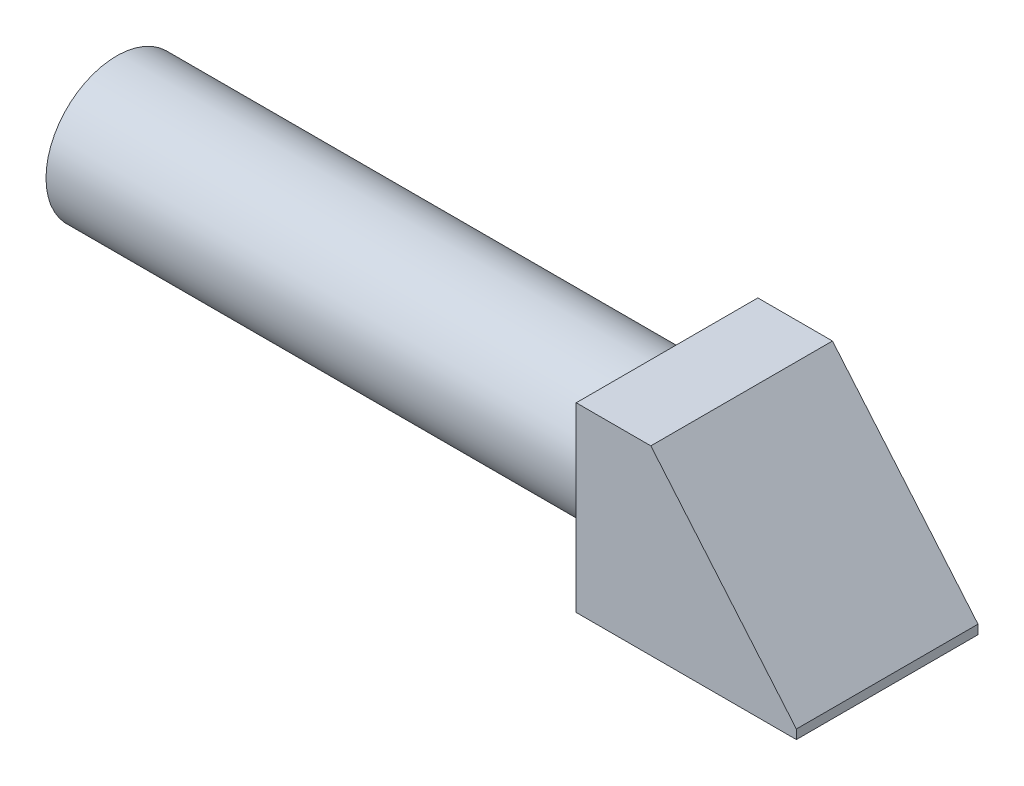
ISO-10303-21;
HEADER;
FILE_DESCRIPTION(('STEP AP214'),'2;1');
FILE_NAME('part.step','',(''),(''),'','','');
FILE_SCHEMA(('AUTOMOTIVE_DESIGN { 1 0 10303 214 1 1 1 1 }'));
ENDSEC;
DATA;
#1=APPLICATION_CONTEXT('core data for automotive mechanical design processes');
#2=APPLICATION_PROTOCOL_DEFINITION('international standard','automotive_design',2000,#1);
#3=PRODUCT_CONTEXT('',#1,'mechanical');
#4=PRODUCT('Part','Part','',(#3));
#5=PRODUCT_RELATED_PRODUCT_CATEGORY('part','',(#4));
#6=PRODUCT_DEFINITION_FORMATION('','',#4);
#7=PRODUCT_DEFINITION_CONTEXT('part definition',#1,'design');
#8=PRODUCT_DEFINITION('design','',#6,#7);
#9=PRODUCT_DEFINITION_SHAPE('','',#8);
#10=(LENGTH_UNIT() NAMED_UNIT(*) SI_UNIT(.MILLI.,.METRE.));
#11=(NAMED_UNIT(*) PLANE_ANGLE_UNIT() SI_UNIT($,.RADIAN.));
#12=(NAMED_UNIT(*) SI_UNIT($,.STERADIAN.) SOLID_ANGLE_UNIT());
#13=UNCERTAINTY_MEASURE_WITH_UNIT(LENGTH_MEASURE(1.E-05),#10,'distance_accuracy_value','');
#14=(GEOMETRIC_REPRESENTATION_CONTEXT(3) GLOBAL_UNCERTAINTY_ASSIGNED_CONTEXT((#13)) GLOBAL_UNIT_ASSIGNED_CONTEXT((#10,
#11,#12)) REPRESENTATION_CONTEXT('',''));
#15=CARTESIAN_POINT('',(0.,0.,0.));
#16=DIRECTION('',(0.,0.,1.));
#17=DIRECTION('',(1.,0.,0.));
#18=AXIS2_PLACEMENT_3D('',#15,#16,#17);
#19=CARTESIAN_POINT('',(55.7037107361909,28.3585661534627,32.5950155706054));
#20=DIRECTION('',(-1.,0.,0.));
#21=DIRECTION('',(0.,0.,1.));
#22=AXIS2_PLACEMENT_3D('',#19,#20,#21);
#23=PLANE('',#22);
#24=DIRECTION('',(0.,0.,1.));
#25=VECTOR('',#24,1.);
#26=CARTESIAN_POINT('',(55.7037107361909,28.8585661534627,37.5450155706054));
#27=LINE('',#26,#25);
#28=CARTESIAN_POINT('',(55.7037107361909,28.8585661534627,32.5950155706054));
#29=VERTEX_POINT('',#28);
#30=CARTESIAN_POINT('',(55.7037107361909,28.8585661534627,42.4950155706054));
#31=VERTEX_POINT('',#30);
#32=EDGE_CURVE('E64',#29,#31,#27,.T.);
#33=ORIENTED_EDGE('',*,*,#32,.T.);
#34=DIRECTION('',(0.,1.,0.));
#35=VECTOR('',#34,1.);
#36=CARTESIAN_POINT('',(55.7037107361909,28.6085661534627,42.4950155706054));
#37=LINE('',#36,#35);
#38=CARTESIAN_POINT('',(55.7037107361909,28.3585661534627,42.4950155706054));
#39=VERTEX_POINT('',#38);
#40=EDGE_CURVE('E77',#39,#31,#37,.T.);
#41=ORIENTED_EDGE('',*,*,#40,.F.);
#42=DIRECTION('',(0.,0.,-1.));
#43=VECTOR('',#42,1.);
#44=CARTESIAN_POINT('',(55.7037107361909,28.3585661534627,37.5450155706054));
#45=LINE('',#44,#43);
#46=CARTESIAN_POINT('',(55.7037107361909,28.3585661534627,32.5950155706054));
#47=VERTEX_POINT('',#46);
#48=EDGE_CURVE('E67',#39,#47,#45,.T.);
#49=ORIENTED_EDGE('',*,*,#48,.T.);
#50=DIRECTION('',(0.,1.,0.));
#51=VECTOR('',#50,1.);
#52=CARTESIAN_POINT('',(55.7037107361909,33.3085661534627,32.5950155706054));
#53=LINE('',#52,#51);
#54=EDGE_CURVE('E62',#47,#29,#53,.T.);
#55=ORIENTED_EDGE('',*,*,#54,.T.);
#56=EDGE_LOOP('',(#33,#41,#49,#55));
#57=FACE_BOUND('',#56,.T.);
#58=ADVANCED_FACE('F16',(#57),#23,.F.);
#59=CARTESIAN_POINT('',(47.7708676141909,38.2585661534627,32.5950155706054));
#60=DIRECTION('',(-0.764227642280811,-0.644946595288256,0.));
#61=DIRECTION('',(0.644946595288256,-0.764227642280811,0.));
#62=AXIS2_PLACEMENT_3D('',#59,#60,#61);
#63=PLANE('',#62);
#64=DIRECTION('',(0.644946595288256,-0.764227642280811,0.));
#65=VECTOR('',#64,1.);
#66=CARTESIAN_POINT('',(47.7708676141909,38.2585661534627,42.4950155706054));
#67=LINE('',#66,#65);
#68=CARTESIAN_POINT('',(47.7708676141909,38.2585661534627,42.4950155706054));
#69=VERTEX_POINT('',#68);
#70=EDGE_CURVE('E76',#69,#31,#67,.T.);
#71=ORIENTED_EDGE('',*,*,#70,.T.);
#72=ORIENTED_EDGE('',*,*,#32,.F.);
#73=DIRECTION('',(0.644946595288256,-0.764227642280811,0.));
#74=VECTOR('',#73,1.);
#75=CARTESIAN_POINT('',(47.7708676141909,38.2585661534627,32.5950155706054));
#76=LINE('',#75,#74);
#77=CARTESIAN_POINT('',(47.7708676141909,38.2585661534627,32.5950155706054));
#78=VERTEX_POINT('',#77);
#79=EDGE_CURVE('E20',#29,#78,#76,.F.);
#80=ORIENTED_EDGE('',*,*,#79,.T.);
#81=DIRECTION('',(0.,0.,1.));
#82=VECTOR('',#81,1.);
#83=CARTESIAN_POINT('',(47.7708676141909,38.2585661534627,37.5450155706054));
#84=LINE('',#83,#82);
#85=EDGE_CURVE('E90',#78,#69,#84,.T.);
#86=ORIENTED_EDGE('',*,*,#85,.T.);
#87=EDGE_LOOP('',(#71,#72,#80,#86));
#88=FACE_BOUND('',#87,.T.);
#89=ADVANCED_FACE('F74',(#88),#63,.F.);
#90=CARTESIAN_POINT('',(13.7037107361909,29.4123661534627,41.4412155706054));
#91=DIRECTION('',(1.,0.,0.));
#92=DIRECTION('',(0.,0.,-1.));
#93=AXIS2_PLACEMENT_3D('',#90,#91,#92);
#94=PLANE('',#93);
#95=CARTESIAN_POINT('',(13.7037107361909,33.3085661534627,37.5450155706054));
#96=DIRECTION('',(-1.,0.,0.));
#97=DIRECTION('',(0.,0.,1.));
#98=AXIS2_PLACEMENT_3D('',#95,#96,#97);
#99=CIRCLE('',#98,3.85);
#100=CARTESIAN_POINT('',(13.7037107361909,33.3085661534627,41.3950155706054));
#101=VERTEX_POINT('',#100);
#102=EDGE_CURVE('E93',#101,#101,#99,.T.);
#103=ORIENTED_EDGE('',*,*,#102,.T.);
#104=EDGE_LOOP('',(#103));
#105=FACE_BOUND('',#104,.T.);
#106=ADVANCED_FACE('F130',(#105),#94,.F.);
#107=CARTESIAN_POINT('',(43.7037107361909,28.3585661534627,32.5950155706054));
#108=DIRECTION('',(0.,0.,1.));
#109=DIRECTION('',(1.,0.,0.));
#110=AXIS2_PLACEMENT_3D('',#107,#108,#109);
#111=PLANE('',#110);
#112=ORIENTED_EDGE('',*,*,#79,.F.);
#113=ORIENTED_EDGE('',*,*,#54,.F.);
#114=DIRECTION('',(-1.,0.,0.));
#115=VECTOR('',#114,1.);
#116=CARTESIAN_POINT('',(49.7037107361909,28.3585661534627,32.5950155706054));
#117=LINE('',#116,#115);
#118=CARTESIAN_POINT('',(43.7037107361909,28.3585661534627,32.5950155706054));
#119=VERTEX_POINT('',#118);
#120=EDGE_CURVE('E83',#47,#119,#117,.T.);
#121=ORIENTED_EDGE('',*,*,#120,.T.);
#122=DIRECTION('',(0.,-1.,0.));
#123=VECTOR('',#122,1.);
#124=CARTESIAN_POINT('',(43.7037107361909,33.3085661534627,32.5950155706054));
#125=LINE('',#124,#123);
#126=CARTESIAN_POINT('',(43.7037107361909,38.2585661534627,32.5950155706054));
#127=VERTEX_POINT('',#126);
#128=EDGE_CURVE('E102',#127,#119,#125,.T.);
#129=ORIENTED_EDGE('',*,*,#128,.F.);
#130=DIRECTION('',(1.,0.,0.));
#131=VECTOR('',#130,1.);
#132=CARTESIAN_POINT('',(45.7372891751909,38.2585661534627,32.5950155706054));
#133=LINE('',#132,#131);
#134=EDGE_CURVE('E81',#127,#78,#133,.T.);
#135=ORIENTED_EDGE('',*,*,#134,.T.);
#136=EDGE_LOOP('',(#112,#113,#121,#129,#135));
#137=FACE_BOUND('',#136,.T.);
#138=ADVANCED_FACE('F79',(#137),#111,.F.);
#139=CARTESIAN_POINT('',(43.7037107361909,28.3585661534627,32.5950155706054));
#140=DIRECTION('',(0.,1.,0.));
#141=DIRECTION('',(0.,0.,1.));
#142=AXIS2_PLACEMENT_3D('',#139,#140,#141);
#143=PLANE('',#142);
#144=ORIENTED_EDGE('',*,*,#120,.F.);
#145=ORIENTED_EDGE('',*,*,#48,.F.);
#146=DIRECTION('',(-1.,0.,0.));
#147=VECTOR('',#146,1.);
#148=CARTESIAN_POINT('',(49.7037107361909,28.3585661534627,42.4950155706054));
#149=LINE('',#148,#147);
#150=CARTESIAN_POINT('',(43.7037107361909,28.3585661534627,42.4950155706054));
#151=VERTEX_POINT('',#150);
#152=EDGE_CURVE('E85',#39,#151,#149,.T.);
#153=ORIENTED_EDGE('',*,*,#152,.T.);
#154=DIRECTION('',(0.,0.,1.));
#155=VECTOR('',#154,1.);
#156=CARTESIAN_POINT('',(43.7037107361909,28.3585661534627,37.5450155706054));
#157=LINE('',#156,#155);
#158=EDGE_CURVE('E109',#119,#151,#157,.T.);
#159=ORIENTED_EDGE('',*,*,#158,.F.);
#160=EDGE_LOOP('',(#144,#145,#153,#159));
#161=FACE_BOUND('',#160,.T.);
#162=ADVANCED_FACE('F121',(#161),#143,.F.);
#163=CARTESIAN_POINT('',(55.7037107361909,28.3585661534627,42.4950155706054));
#164=DIRECTION('',(0.,0.,-1.));
#165=DIRECTION('',(-1.,0.,0.));
#166=AXIS2_PLACEMENT_3D('',#163,#164,#165);
#167=PLANE('',#166);
#168=ORIENTED_EDGE('',*,*,#70,.F.);
#169=DIRECTION('',(-1.,0.,0.));
#170=VECTOR('',#169,1.);
#171=CARTESIAN_POINT('',(45.7372891751909,38.2585661534627,42.4950155706054));
#172=LINE('',#171,#170);
#173=CARTESIAN_POINT('',(43.7037107361909,38.2585661534627,42.4950155706054));
#174=VERTEX_POINT('',#173);
#175=EDGE_CURVE('E35',#69,#174,#172,.T.);
#176=ORIENTED_EDGE('',*,*,#175,.T.);
#177=DIRECTION('',(0.,1.,0.));
#178=VECTOR('',#177,1.);
#179=CARTESIAN_POINT('',(43.7037107361909,33.3085661534627,42.4950155706054));
#180=LINE('',#179,#178);
#181=EDGE_CURVE('E112',#151,#174,#180,.T.);
#182=ORIENTED_EDGE('',*,*,#181,.F.);
#183=ORIENTED_EDGE('',*,*,#152,.F.);
#184=ORIENTED_EDGE('',*,*,#40,.T.);
#185=EDGE_LOOP('',(#168,#176,#182,#183,#184));
#186=FACE_BOUND('',#185,.T.);
#187=ADVANCED_FACE('F120',(#186),#167,.F.);
#188=CARTESIAN_POINT('',(43.7037107361909,38.2585661534627,42.4950155706054));
#189=DIRECTION('',(0.,-1.,0.));
#190=DIRECTION('',(0.,0.,-1.));
#191=AXIS2_PLACEMENT_3D('',#188,#189,#190);
#192=PLANE('',#191);
#193=ORIENTED_EDGE('',*,*,#85,.F.);
#194=ORIENTED_EDGE('',*,*,#134,.F.);
#195=DIRECTION('',(0.,0.,-1.));
#196=VECTOR('',#195,1.);
#197=CARTESIAN_POINT('',(43.7037107361909,38.2585661534627,37.5450155706054));
#198=LINE('',#197,#196);
#199=EDGE_CURVE('E100',#174,#127,#198,.T.);
#200=ORIENTED_EDGE('',*,*,#199,.F.);
#201=ORIENTED_EDGE('',*,*,#175,.F.);
#202=EDGE_LOOP('',(#193,#194,#200,#201));
#203=FACE_BOUND('',#202,.T.);
#204=ADVANCED_FACE('F119',(#203),#192,.F.);
#205=CARTESIAN_POINT('',(42.7037107361909,33.3085661534627,37.5450155706054));
#206=DIRECTION('',(-1.,0.,0.));
#207=DIRECTION('',(0.,0.,1.));
#208=AXIS2_PLACEMENT_3D('',#205,#206,#207);
#209=CYLINDRICAL_SURFACE('',#208,3.85);
#210=ORIENTED_EDGE('',*,*,#102,.F.);
#211=EDGE_LOOP('',(#210));
#212=FACE_BOUND('',#211,.T.);
#213=CARTESIAN_POINT('',(42.7037107361909,33.3085661534627,37.5450155706054));
#214=DIRECTION('',(-1.,0.,0.));
#215=DIRECTION('',(0.,0.,1.));
#216=AXIS2_PLACEMENT_3D('',#213,#214,#215);
#217=CIRCLE('',#216,3.85);
#218=CARTESIAN_POINT('',(42.7037107361909,33.3085661534627,41.3950155706054));
#219=VERTEX_POINT('',#218);
#220=EDGE_CURVE('E97',#219,#219,#217,.F.);
#221=ORIENTED_EDGE('',*,*,#220,.F.);
#222=EDGE_LOOP('',(#221));
#223=FACE_BOUND('',#222,.T.);
#224=ADVANCED_FACE('F143',(#212,#223),#209,.T.);
#225=CARTESIAN_POINT('',(43.7037107361909,28.3585661534627,32.5950155706054));
#226=DIRECTION('',(-1.,0.,0.));
#227=DIRECTION('',(0.,0.,1.));
#228=AXIS2_PLACEMENT_3D('',#225,#226,#227);
#229=PLANE('',#228);
#230=CARTESIAN_POINT('',(43.7037107361909,33.3085661534627,37.5450155706054));
#231=DIRECTION('',(1.,0.,0.));
#232=DIRECTION('',(0.,0.,-1.));
#233=AXIS2_PLACEMENT_3D('',#230,#231,#232);
#234=CIRCLE('',#233,3.25);
#235=CARTESIAN_POINT('',(43.7037107361909,33.3085661534627,34.2950155706054));
#236=VERTEX_POINT('',#235);
#237=EDGE_CURVE('E26',#236,#236,#234,.T.);
#238=ORIENTED_EDGE('',*,*,#237,.T.);
#239=EDGE_LOOP('',(#238));
#240=FACE_BOUND('',#239,.T.);
#241=ORIENTED_EDGE('',*,*,#181,.T.);
#242=ORIENTED_EDGE('',*,*,#199,.T.);
#243=ORIENTED_EDGE('',*,*,#128,.T.);
#244=ORIENTED_EDGE('',*,*,#158,.T.);
#245=EDGE_LOOP('',(#241,#242,#243,#244));
#246=FACE_BOUND('',#245,.T.);
#247=ADVANCED_FACE('F117',(#240,#246),#229,.T.);
#248=CARTESIAN_POINT('',(42.7037107361909,29.4123661534627,41.4412155706054));
#249=DIRECTION('',(1.,0.,0.));
#250=DIRECTION('',(0.,0.,-1.));
#251=AXIS2_PLACEMENT_3D('',#248,#249,#250);
#252=PLANE('',#251);
#253=CARTESIAN_POINT('',(42.7037107361909,33.3085661534627,37.5450155706054));
#254=DIRECTION('',(1.,0.,0.));
#255=DIRECTION('',(0.,0.,-1.));
#256=AXIS2_PLACEMENT_3D('',#253,#254,#255);
#257=CIRCLE('',#256,3.25);
#258=CARTESIAN_POINT('',(42.7037107361909,33.3085661534627,34.2950155706054));
#259=VERTEX_POINT('',#258);
#260=EDGE_CURVE('E10',#259,#259,#257,.F.);
#261=ORIENTED_EDGE('',*,*,#260,.T.);
#262=EDGE_LOOP('',(#261));
#263=FACE_BOUND('',#262,.T.);
#264=ORIENTED_EDGE('',*,*,#220,.T.);
#265=EDGE_LOOP('',(#264));
#266=FACE_BOUND('',#265,.T.);
#267=ADVANCED_FACE('F18',(#263,#266),#252,.T.);
#268=CARTESIAN_POINT('',(42.7037107361909,33.3085661534627,37.5450155706054));
#269=DIRECTION('',(1.,0.,0.));
#270=DIRECTION('',(0.,0.,-1.));
#271=AXIS2_PLACEMENT_3D('',#268,#269,#270);
#272=CYLINDRICAL_SURFACE('',#271,3.25);
#273=ORIENTED_EDGE('',*,*,#260,.F.);
#274=EDGE_LOOP('',(#273));
#275=FACE_BOUND('',#274,.T.);
#276=ORIENTED_EDGE('',*,*,#237,.F.);
#277=EDGE_LOOP('',(#276));
#278=FACE_BOUND('',#277,.T.);
#279=ADVANCED_FACE('F132',(#275,#278),#272,.T.);
#280=CLOSED_SHELL('',(#58,#89,#106,#138,#162,#187,#204,#224,#247,#267,#279));
#281=MANIFOLD_SOLID_BREP('B1',#280);
#282=ADVANCED_BREP_SHAPE_REPRESENTATION('',(#18,#281),#14);
#283=SHAPE_DEFINITION_REPRESENTATION(#9,#282);
ENDSEC;
END-ISO-10303-21;
